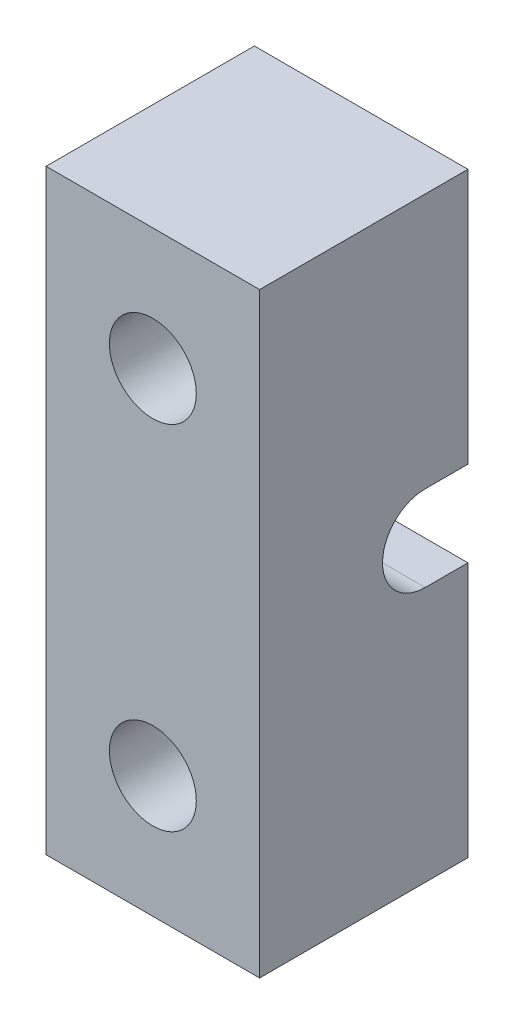
ISO-10303-21;
HEADER;
FILE_DESCRIPTION(('STEP AP214'),'2;1');
FILE_NAME('part.step','',(''),(''),'','','');
FILE_SCHEMA(('AUTOMOTIVE_DESIGN { 1 0 10303 214 1 1 1 1 }'));
ENDSEC;
DATA;
#1=APPLICATION_CONTEXT('core data for automotive mechanical design processes');
#2=APPLICATION_PROTOCOL_DEFINITION('international standard','automotive_design',2000,#1);
#3=PRODUCT_CONTEXT('',#1,'mechanical');
#4=PRODUCT('Part','Part','',(#3));
#5=PRODUCT_RELATED_PRODUCT_CATEGORY('part','',(#4));
#6=PRODUCT_DEFINITION_FORMATION('','',#4);
#7=PRODUCT_DEFINITION_CONTEXT('part definition',#1,'design');
#8=PRODUCT_DEFINITION('design','',#6,#7);
#9=PRODUCT_DEFINITION_SHAPE('','',#8);
#10=(LENGTH_UNIT() NAMED_UNIT(*) SI_UNIT(.MILLI.,.METRE.));
#11=(NAMED_UNIT(*) PLANE_ANGLE_UNIT() SI_UNIT($,.RADIAN.));
#12=(NAMED_UNIT(*) SI_UNIT($,.STERADIAN.) SOLID_ANGLE_UNIT());
#13=UNCERTAINTY_MEASURE_WITH_UNIT(LENGTH_MEASURE(1.E-05),#10,'distance_accuracy_value','');
#14=(GEOMETRIC_REPRESENTATION_CONTEXT(3) GLOBAL_UNCERTAINTY_ASSIGNED_CONTEXT((#13)) GLOBAL_UNIT_ASSIGNED_CONTEXT((#10,
#11,#12)) REPRESENTATION_CONTEXT('',''));
#15=CARTESIAN_POINT('',(0.,0.,0.));
#16=DIRECTION('',(0.,0.,1.));
#17=DIRECTION('',(1.,0.,0.));
#18=AXIS2_PLACEMENT_3D('',#15,#16,#17);
#19=CARTESIAN_POINT('',(0.,0.,0.));
#20=DIRECTION('',(0.,0.,1.));
#21=DIRECTION('',(1.,0.,0.));
#22=AXIS2_PLACEMENT_3D('',#19,#20,#21);
#23=PLANE('',#22);
#24=CARTESIAN_POINT('',(215.9,-12.7,0.));
#25=DIRECTION('',(0.,0.,1.));
#26=DIRECTION('',(1.,0.,0.));
#27=AXIS2_PLACEMENT_3D('',#24,#25,#26);
#28=CIRCLE('',#27,3.12922559806611);
#29=CARTESIAN_POINT('',(219.029225598066,-12.7,0.));
#30=VERTEX_POINT('',#29);
#31=EDGE_CURVE('E172',#30,#30,#28,.T.);
#32=ORIENTED_EDGE('',*,*,#31,.T.);
#33=EDGE_LOOP('',(#32));
#34=FACE_BOUND('',#33,.T.);
#35=DIRECTION('',(0.,-1.,0.));
#36=VECTOR('',#35,1.);
#37=CARTESIAN_POINT('',(208.211222580918,-21.4656069041947,0.));
#38=LINE('',#37,#36);
#39=CARTESIAN_POINT('',(208.211222580918,-3.075,0.));
#40=VERTEX_POINT('',#39);
#41=CARTESIAN_POINT('',(208.211222580918,-21.4656069041947,0.));
#42=VERTEX_POINT('',#41);
#43=EDGE_CURVE('E144',#40,#42,#38,.T.);
#44=ORIENTED_EDGE('',*,*,#43,.F.);
#45=DIRECTION('',(1.,0.,0.));
#46=VECTOR('',#45,1.);
#47=CARTESIAN_POINT('',(208.211222580918,-3.075,0.));
#48=LINE('',#47,#46);
#49=CARTESIAN_POINT('',(223.588777419082,-3.075,0.));
#50=VERTEX_POINT('',#49);
#51=EDGE_CURVE('E195',#40,#50,#48,.T.);
#52=ORIENTED_EDGE('',*,*,#51,.T.);
#53=DIRECTION('',(0.,1.,0.));
#54=VECTOR('',#53,1.);
#55=CARTESIAN_POINT('',(223.588777419082,-21.4656069041947,0.));
#56=LINE('',#55,#54);
#57=CARTESIAN_POINT('',(223.588777419082,-21.4656069041947,0.));
#58=VERTEX_POINT('',#57);
#59=EDGE_CURVE('E174',#58,#50,#56,.T.);
#60=ORIENTED_EDGE('',*,*,#59,.F.);
#61=DIRECTION('',(1.,0.,0.));
#62=VECTOR('',#61,1.);
#63=CARTESIAN_POINT('',(223.588777419082,-21.4656069041947,0.));
#64=LINE('',#63,#62);
#65=EDGE_CURVE('E89',#42,#58,#64,.T.);
#66=ORIENTED_EDGE('',*,*,#65,.F.);
#67=EDGE_LOOP('',(#44,#52,#60,#66));
#68=FACE_BOUND('',#67,.T.);
#69=ADVANCED_FACE('F43',(#34,#68),#23,.F.);
#70=CARTESIAN_POINT('',(0.,0.,15.));
#71=DIRECTION('',(0.,0.,1.));
#72=DIRECTION('',(1.,0.,0.));
#73=AXIS2_PLACEMENT_3D('',#70,#71,#72);
#74=PLANE('',#73);
#75=CARTESIAN_POINT('',(215.9,-12.7,15.));
#76=DIRECTION('',(0.,0.,1.));
#77=DIRECTION('',(1.,0.,0.));
#78=AXIS2_PLACEMENT_3D('',#75,#76,#77);
#79=CIRCLE('',#78,3.12922559806611);
#80=CARTESIAN_POINT('',(219.029225598066,-12.7,15.));
#81=VERTEX_POINT('',#80);
#82=EDGE_CURVE('E182',#81,#81,#79,.T.);
#83=ORIENTED_EDGE('',*,*,#82,.F.);
#84=EDGE_LOOP('',(#83));
#85=FACE_BOUND('',#84,.T.);
#86=DIRECTION('',(0.,1.,0.));
#87=VECTOR('',#86,1.);
#88=CARTESIAN_POINT('',(223.588777419082,-21.4656069041947,15.));
#89=LINE('',#88,#87);
#90=CARTESIAN_POINT('',(223.588777419082,-21.4656069041947,15.));
#91=VERTEX_POINT('',#90);
#92=CARTESIAN_POINT('',(223.588777419082,21.4656069041947,15.));
#93=VERTEX_POINT('',#92);
#94=EDGE_CURVE('E148',#91,#93,#89,.T.);
#95=ORIENTED_EDGE('',*,*,#94,.T.);
#96=DIRECTION('',(-1.,0.,0.));
#97=VECTOR('',#96,1.);
#98=CARTESIAN_POINT('',(223.588777419082,21.4656069041947,15.));
#99=LINE('',#98,#97);
#100=CARTESIAN_POINT('',(208.211222580918,21.4656069041947,15.));
#101=VERTEX_POINT('',#100);
#102=EDGE_CURVE('E96',#93,#101,#99,.T.);
#103=ORIENTED_EDGE('',*,*,#102,.T.);
#104=DIRECTION('',(0.,-1.,0.));
#105=VECTOR('',#104,1.);
#106=CARTESIAN_POINT('',(208.211222580918,-21.4656069041947,15.));
#107=LINE('',#106,#105);
#108=CARTESIAN_POINT('',(208.211222580918,-21.4656069041947,15.));
#109=VERTEX_POINT('',#108);
#110=EDGE_CURVE('E162',#101,#109,#107,.T.);
#111=ORIENTED_EDGE('',*,*,#110,.T.);
#112=DIRECTION('',(1.,0.,0.));
#113=VECTOR('',#112,1.);
#114=CARTESIAN_POINT('',(223.588777419082,-21.4656069041947,15.));
#115=LINE('',#114,#113);
#116=EDGE_CURVE('E68',#109,#91,#115,.T.);
#117=ORIENTED_EDGE('',*,*,#116,.T.);
#118=EDGE_LOOP('',(#95,#103,#111,#117));
#119=FACE_BOUND('',#118,.T.);
#120=CARTESIAN_POINT('',(215.9,12.7,15.));
#121=DIRECTION('',(0.,0.,1.));
#122=DIRECTION('',(1.,0.,0.));
#123=AXIS2_PLACEMENT_3D('',#120,#121,#122);
#124=CIRCLE('',#123,3.12922559806611);
#125=CARTESIAN_POINT('',(219.029225598066,12.7,15.));
#126=VERTEX_POINT('',#125);
#127=EDGE_CURVE('E189',#126,#126,#124,.T.);
#128=ORIENTED_EDGE('',*,*,#127,.F.);
#129=EDGE_LOOP('',(#128));
#130=FACE_BOUND('',#129,.T.);
#131=ADVANCED_FACE('F238',(#85,#119,#130),#74,.T.);
#132=CARTESIAN_POINT('',(223.588777419082,3.075,0.));
#133=VERTEX_POINT('',#132);
#134=CARTESIAN_POINT('',(223.588777419082,21.4656069041947,0.));
#135=VERTEX_POINT('',#134);
#136=EDGE_CURVE('E136',#133,#135,#56,.T.);
#137=ORIENTED_EDGE('',*,*,#136,.F.);
#138=DIRECTION('',(1.,0.,0.));
#139=VECTOR('',#138,1.);
#140=CARTESIAN_POINT('',(208.211222580918,3.075,0.));
#141=LINE('',#140,#139);
#142=CARTESIAN_POINT('',(208.211222580918,3.075,0.));
#143=VERTEX_POINT('',#142);
#144=EDGE_CURVE('E121',#143,#133,#141,.T.);
#145=ORIENTED_EDGE('',*,*,#144,.F.);
#146=CARTESIAN_POINT('',(208.211222580918,21.4656069041947,0.));
#147=VERTEX_POINT('',#146);
#148=EDGE_CURVE('E135',#147,#143,#38,.T.);
#149=ORIENTED_EDGE('',*,*,#148,.F.);
#150=DIRECTION('',(-1.,0.,0.));
#151=VECTOR('',#150,1.);
#152=CARTESIAN_POINT('',(223.588777419082,21.4656069041947,0.));
#153=LINE('',#152,#151);
#154=EDGE_CURVE('E150',#135,#147,#153,.T.);
#155=ORIENTED_EDGE('',*,*,#154,.F.);
#156=EDGE_LOOP('',(#137,#145,#149,#155));
#157=FACE_BOUND('',#156,.T.);
#158=CARTESIAN_POINT('',(215.9,12.7,0.));
#159=DIRECTION('',(0.,0.,1.));
#160=DIRECTION('',(1.,0.,0.));
#161=AXIS2_PLACEMENT_3D('',#158,#159,#160);
#162=CIRCLE('',#161,3.12922559806611);
#163=CARTESIAN_POINT('',(219.029225598066,12.7,0.));
#164=VERTEX_POINT('',#163);
#165=EDGE_CURVE('E191',#164,#164,#162,.T.);
#166=ORIENTED_EDGE('',*,*,#165,.T.);
#167=EDGE_LOOP('',(#166));
#168=FACE_BOUND('',#167,.T.);
#169=ADVANCED_FACE('F132',(#157,#168),#23,.F.);
#170=CARTESIAN_POINT('',(223.588777419082,-21.4656069041947,15.));
#171=DIRECTION('',(-1.,0.,0.));
#172=DIRECTION('',(0.,0.,1.));
#173=AXIS2_PLACEMENT_3D('',#170,#171,#172);
#174=PLANE('',#173);
#175=ORIENTED_EDGE('',*,*,#59,.T.);
#176=DIRECTION('',(0.,0.,-1.));
#177=VECTOR('',#176,1.);
#178=CARTESIAN_POINT('',(223.588777419082,-3.075,0.));
#179=LINE('',#178,#177);
#180=CARTESIAN_POINT('',(223.588777419082,-3.075,3.075));
#181=VERTEX_POINT('',#180);
#182=EDGE_CURVE('E127',#181,#50,#179,.T.);
#183=ORIENTED_EDGE('',*,*,#182,.F.);
#184=CARTESIAN_POINT('',(223.588777419082,0.,3.075));
#185=DIRECTION('',(1.,0.,0.));
#186=DIRECTION('',(0.,0.,-1.));
#187=AXIS2_PLACEMENT_3D('',#184,#185,#186);
#188=CIRCLE('',#187,3.075);
#189=CARTESIAN_POINT('',(223.588777419082,3.075,3.075));
#190=VERTEX_POINT('',#189);
#191=EDGE_CURVE('E209',#190,#181,#188,.T.);
#192=ORIENTED_EDGE('',*,*,#191,.F.);
#193=DIRECTION('',(0.,0.,1.));
#194=VECTOR('',#193,1.);
#195=CARTESIAN_POINT('',(223.588777419082,3.075,0.));
#196=LINE('',#195,#194);
#197=EDGE_CURVE('E213',#133,#190,#196,.T.);
#198=ORIENTED_EDGE('',*,*,#197,.F.);
#199=ORIENTED_EDGE('',*,*,#136,.T.);
#200=DIRECTION('',(0.,0.,-1.));
#201=VECTOR('',#200,1.);
#202=CARTESIAN_POINT('',(223.588777419082,21.4656069041947,15.));
#203=LINE('',#202,#201);
#204=EDGE_CURVE('E11',#93,#135,#203,.T.);
#205=ORIENTED_EDGE('',*,*,#204,.F.);
#206=ORIENTED_EDGE('',*,*,#94,.F.);
#207=DIRECTION('',(0.,0.,-1.));
#208=VECTOR('',#207,1.);
#209=CARTESIAN_POINT('',(223.588777419082,-21.4656069041947,15.));
#210=LINE('',#209,#208);
#211=EDGE_CURVE('E154',#91,#58,#210,.T.);
#212=ORIENTED_EDGE('',*,*,#211,.T.);
#213=EDGE_LOOP('',(#175,#183,#192,#198,#199,#205,#206,#212));
#214=FACE_BOUND('',#213,.T.);
#215=ADVANCED_FACE('F45',(#214),#174,.F.);
#216=CARTESIAN_POINT('',(223.588777419082,21.4656069041947,15.));
#217=DIRECTION('',(0.,-1.,0.));
#218=DIRECTION('',(1.,0.,0.));
#219=AXIS2_PLACEMENT_3D('',#216,#217,#218);
#220=PLANE('',#219);
#221=ORIENTED_EDGE('',*,*,#154,.T.);
#222=DIRECTION('',(0.,0.,-1.));
#223=VECTOR('',#222,1.);
#224=CARTESIAN_POINT('',(208.211222580918,21.4656069041947,15.));
#225=LINE('',#224,#223);
#226=EDGE_CURVE('E52',#101,#147,#225,.T.);
#227=ORIENTED_EDGE('',*,*,#226,.F.);
#228=ORIENTED_EDGE('',*,*,#102,.F.);
#229=ORIENTED_EDGE('',*,*,#204,.T.);
#230=EDGE_LOOP('',(#221,#227,#228,#229));
#231=FACE_BOUND('',#230,.T.);
#232=ADVANCED_FACE('F251',(#231),#220,.F.);
#233=CARTESIAN_POINT('',(208.211222580918,-21.4656069041947,15.));
#234=DIRECTION('',(1.,0.,0.));
#235=DIRECTION('',(0.,0.,-1.));
#236=AXIS2_PLACEMENT_3D('',#233,#234,#235);
#237=PLANE('',#236);
#238=CARTESIAN_POINT('',(208.211222580918,0.,3.075));
#239=DIRECTION('',(1.,0.,0.));
#240=DIRECTION('',(0.,0.,-1.));
#241=AXIS2_PLACEMENT_3D('',#238,#239,#240);
#242=CIRCLE('',#241,3.075);
#243=CARTESIAN_POINT('',(208.211222580918,3.075,3.075));
#244=VERTEX_POINT('',#243);
#245=CARTESIAN_POINT('',(208.211222580918,-3.075,3.075));
#246=VERTEX_POINT('',#245);
#247=EDGE_CURVE('E59',#244,#246,#242,.T.);
#248=ORIENTED_EDGE('',*,*,#247,.T.);
#249=DIRECTION('',(0.,0.,-1.));
#250=VECTOR('',#249,1.);
#251=CARTESIAN_POINT('',(208.211222580918,-3.075,0.));
#252=LINE('',#251,#250);
#253=EDGE_CURVE('E138',#246,#40,#252,.T.);
#254=ORIENTED_EDGE('',*,*,#253,.T.);
#255=ORIENTED_EDGE('',*,*,#43,.T.);
#256=DIRECTION('',(0.,0.,-1.));
#257=VECTOR('',#256,1.);
#258=CARTESIAN_POINT('',(208.211222580918,-21.4656069041947,15.));
#259=LINE('',#258,#257);
#260=EDGE_CURVE('E157',#109,#42,#259,.T.);
#261=ORIENTED_EDGE('',*,*,#260,.F.);
#262=ORIENTED_EDGE('',*,*,#110,.F.);
#263=ORIENTED_EDGE('',*,*,#226,.T.);
#264=ORIENTED_EDGE('',*,*,#148,.T.);
#265=DIRECTION('',(0.,0.,1.));
#266=VECTOR('',#265,1.);
#267=CARTESIAN_POINT('',(208.211222580918,3.075,0.));
#268=LINE('',#267,#266);
#269=EDGE_CURVE('E117',#143,#244,#268,.T.);
#270=ORIENTED_EDGE('',*,*,#269,.T.);
#271=EDGE_LOOP('',(#248,#254,#255,#261,#262,#263,#264,#270));
#272=FACE_BOUND('',#271,.T.);
#273=ADVANCED_FACE('F141',(#272),#237,.F.);
#274=CARTESIAN_POINT('',(223.588777419082,-21.4656069041947,15.));
#275=DIRECTION('',(0.,1.,0.));
#276=DIRECTION('',(-1.,0.,0.));
#277=AXIS2_PLACEMENT_3D('',#274,#275,#276);
#278=PLANE('',#277);
#279=ORIENTED_EDGE('',*,*,#65,.T.);
#280=ORIENTED_EDGE('',*,*,#211,.F.);
#281=ORIENTED_EDGE('',*,*,#116,.F.);
#282=ORIENTED_EDGE('',*,*,#260,.T.);
#283=EDGE_LOOP('',(#279,#280,#281,#282));
#284=FACE_BOUND('',#283,.T.);
#285=ADVANCED_FACE('F258',(#284),#278,.F.);
#286=CARTESIAN_POINT('',(215.9,-12.7,15.));
#287=DIRECTION('',(0.,0.,-1.));
#288=DIRECTION('',(-1.,0.,0.));
#289=AXIS2_PLACEMENT_3D('',#286,#287,#288);
#290=CYLINDRICAL_SURFACE('',#289,3.12922559806611);
#291=ORIENTED_EDGE('',*,*,#82,.T.);
#292=EDGE_LOOP('',(#291));
#293=FACE_BOUND('',#292,.T.);
#294=ORIENTED_EDGE('',*,*,#31,.F.);
#295=EDGE_LOOP('',(#294));
#296=FACE_BOUND('',#295,.T.);
#297=ADVANCED_FACE('F261',(#293,#296),#290,.F.);
#298=CARTESIAN_POINT('',(215.9,12.7,15.));
#299=DIRECTION('',(0.,0.,-1.));
#300=DIRECTION('',(-1.,0.,0.));
#301=AXIS2_PLACEMENT_3D('',#298,#299,#300);
#302=CYLINDRICAL_SURFACE('',#301,3.12922559806611);
#303=ORIENTED_EDGE('',*,*,#127,.T.);
#304=EDGE_LOOP('',(#303));
#305=FACE_BOUND('',#304,.T.);
#306=ORIENTED_EDGE('',*,*,#165,.F.);
#307=EDGE_LOOP('',(#306));
#308=FACE_BOUND('',#307,.T.);
#309=ADVANCED_FACE('F235',(#305,#308),#302,.F.);
#310=CARTESIAN_POINT('',(208.211222580918,-3.075,0.));
#311=DIRECTION('',(0.,-1.,0.));
#312=DIRECTION('',(0.,0.,-1.));
#313=AXIS2_PLACEMENT_3D('',#310,#311,#312);
#314=PLANE('',#313);
#315=ORIENTED_EDGE('',*,*,#182,.T.);
#316=ORIENTED_EDGE('',*,*,#51,.F.);
#317=ORIENTED_EDGE('',*,*,#253,.F.);
#318=DIRECTION('',(1.,0.,0.));
#319=VECTOR('',#318,1.);
#320=CARTESIAN_POINT('',(208.211222580918,-3.075,3.075));
#321=LINE('',#320,#319);
#322=EDGE_CURVE('E201',#246,#181,#321,.T.);
#323=ORIENTED_EDGE('',*,*,#322,.T.);
#324=EDGE_LOOP('',(#315,#316,#317,#323));
#325=FACE_BOUND('',#324,.T.);
#326=ADVANCED_FACE('F225',(#325),#314,.F.);
#327=CARTESIAN_POINT('',(208.211222580918,0.,3.075));
#328=DIRECTION('',(1.,0.,0.));
#329=DIRECTION('',(0.,0.,-1.));
#330=AXIS2_PLACEMENT_3D('',#327,#328,#329);
#331=CYLINDRICAL_SURFACE('',#330,3.075);
#332=ORIENTED_EDGE('',*,*,#191,.T.);
#333=ORIENTED_EDGE('',*,*,#322,.F.);
#334=ORIENTED_EDGE('',*,*,#247,.F.);
#335=DIRECTION('',(1.,0.,0.));
#336=VECTOR('',#335,1.);
#337=CARTESIAN_POINT('',(208.211222580918,3.075,3.075));
#338=LINE('',#337,#336);
#339=EDGE_CURVE('E123',#244,#190,#338,.T.);
#340=ORIENTED_EDGE('',*,*,#339,.T.);
#341=EDGE_LOOP('',(#332,#333,#334,#340));
#342=FACE_BOUND('',#341,.T.);
#343=ADVANCED_FACE('F227',(#342),#331,.F.);
#344=CARTESIAN_POINT('',(208.211222580918,3.075,0.));
#345=DIRECTION('',(0.,1.,0.));
#346=DIRECTION('',(0.,0.,1.));
#347=AXIS2_PLACEMENT_3D('',#344,#345,#346);
#348=PLANE('',#347);
#349=ORIENTED_EDGE('',*,*,#197,.T.);
#350=ORIENTED_EDGE('',*,*,#339,.F.);
#351=ORIENTED_EDGE('',*,*,#269,.F.);
#352=ORIENTED_EDGE('',*,*,#144,.T.);
#353=EDGE_LOOP('',(#349,#350,#351,#352));
#354=FACE_BOUND('',#353,.T.);
#355=ADVANCED_FACE('F120',(#354),#348,.F.);
#356=CLOSED_SHELL('',(#69,#131,#169,#215,#232,#273,#285,#297,#309,#326,#343,#355));
#357=MANIFOLD_SOLID_BREP('B2',#356);
#358=ADVANCED_BREP_SHAPE_REPRESENTATION('',(#18,#357),#14);
#359=SHAPE_DEFINITION_REPRESENTATION(#9,#358);
ENDSEC;
END-ISO-10303-21;
